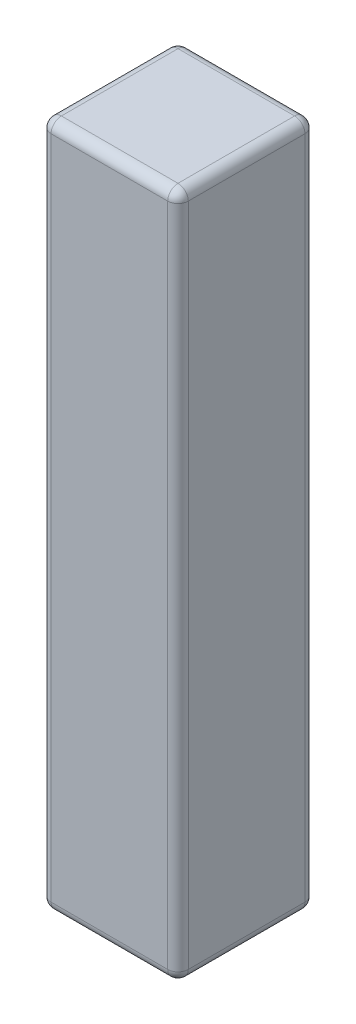
ISO-10303-21;
HEADER;
FILE_DESCRIPTION(('STEP AP214'),'2;1');
FILE_NAME('part.step','',(''),(''),'','','');
FILE_SCHEMA(('AUTOMOTIVE_DESIGN { 1 0 10303 214 1 1 1 1 }'));
ENDSEC;
DATA;
#1=APPLICATION_CONTEXT('core data for automotive mechanical design processes');
#2=APPLICATION_PROTOCOL_DEFINITION('international standard','automotive_design',2000,#1);
#3=PRODUCT_CONTEXT('',#1,'mechanical');
#4=PRODUCT('Part','Part','',(#3));
#5=PRODUCT_RELATED_PRODUCT_CATEGORY('part','',(#4));
#6=PRODUCT_DEFINITION_FORMATION('','',#4);
#7=PRODUCT_DEFINITION_CONTEXT('part definition',#1,'design');
#8=PRODUCT_DEFINITION('design','',#6,#7);
#9=PRODUCT_DEFINITION_SHAPE('','',#8);
#10=(LENGTH_UNIT() NAMED_UNIT(*) SI_UNIT(.MILLI.,.METRE.));
#11=(NAMED_UNIT(*) PLANE_ANGLE_UNIT() SI_UNIT($,.RADIAN.));
#12=(NAMED_UNIT(*) SI_UNIT($,.STERADIAN.) SOLID_ANGLE_UNIT());
#13=UNCERTAINTY_MEASURE_WITH_UNIT(LENGTH_MEASURE(1.E-05),#10,'distance_accuracy_value','');
#14=(GEOMETRIC_REPRESENTATION_CONTEXT(3) GLOBAL_UNCERTAINTY_ASSIGNED_CONTEXT((#13)) GLOBAL_UNIT_ASSIGNED_CONTEXT((#10,
#11,#12)) REPRESENTATION_CONTEXT('',''));
#15=CARTESIAN_POINT('',(0.,0.,0.));
#16=DIRECTION('',(0.,0.,1.));
#17=DIRECTION('',(1.,0.,0.));
#18=AXIS2_PLACEMENT_3D('',#15,#16,#17);
#19=CARTESIAN_POINT('',(-1.00000054,5.,-1.00000054));
#20=DIRECTION('',(1.,0.,0.));
#21=DIRECTION('',(0.,0.,-1.));
#22=AXIS2_PLACEMENT_3D('',#19,#20,#21);
#23=PLANE('',#22);
#24=DIRECTION('',(0.,-1.,0.));
#25=VECTOR('',#24,1.);
#26=CARTESIAN_POINT('',(-1.00000054,5.,0.85000054));
#27=LINE('',#26,#25);
#28=CARTESIAN_POINT('',(-1.00000054,-4.85,0.85000054));
#29=VERTEX_POINT('',#28);
#30=CARTESIAN_POINT('',(-1.00000054,4.85,0.85000054));
#31=VERTEX_POINT('',#30);
#32=EDGE_CURVE('E214',#29,#31,#27,.F.);
#33=ORIENTED_EDGE('',*,*,#32,.T.);
#34=DIRECTION('',(0.,0.,1.));
#35=VECTOR('',#34,1.);
#36=CARTESIAN_POINT('',(-1.00000054,4.85,-1.00000054));
#37=LINE('',#36,#35);
#38=CARTESIAN_POINT('',(-1.00000054,4.85,-0.85000054));
#39=VERTEX_POINT('',#38);
#40=EDGE_CURVE('E217',#31,#39,#37,.F.);
#41=ORIENTED_EDGE('',*,*,#40,.T.);
#42=DIRECTION('',(0.,-1.,0.));
#43=VECTOR('',#42,1.);
#44=CARTESIAN_POINT('',(-1.00000054,5.,-0.85000054));
#45=LINE('',#44,#43);
#46=CARTESIAN_POINT('',(-1.00000054,-4.85,-0.85000054));
#47=VERTEX_POINT('',#46);
#48=EDGE_CURVE('E215',#39,#47,#45,.T.);
#49=ORIENTED_EDGE('',*,*,#48,.T.);
#50=DIRECTION('',(0.,0.,1.));
#51=VECTOR('',#50,1.);
#52=CARTESIAN_POINT('',(-1.00000054,-4.85,-1.00000054));
#53=LINE('',#52,#51);
#54=EDGE_CURVE('E211',#47,#29,#53,.T.);
#55=ORIENTED_EDGE('',*,*,#54,.T.);
#56=EDGE_LOOP('',(#33,#41,#49,#55));
#57=FACE_BOUND('',#56,.T.);
#58=ADVANCED_FACE('F32',(#57),#23,.F.);
#59=CARTESIAN_POINT('',(-1.00000054,5.,1.00000054));
#60=DIRECTION('',(0.,0.,-1.));
#61=DIRECTION('',(-1.,0.,0.));
#62=AXIS2_PLACEMENT_3D('',#59,#60,#61);
#63=PLANE('',#62);
#64=DIRECTION('',(1.,0.,0.));
#65=VECTOR('',#64,1.);
#66=CARTESIAN_POINT('',(-1.00000054,-4.85,1.00000054));
#67=LINE('',#66,#65);
#68=CARTESIAN_POINT('',(-0.85000054,-4.85,1.00000054));
#69=VERTEX_POINT('',#68);
#70=CARTESIAN_POINT('',(0.85000054,-4.85,1.00000054));
#71=VERTEX_POINT('',#70);
#72=EDGE_CURVE('E255',#69,#71,#67,.T.);
#73=ORIENTED_EDGE('',*,*,#72,.T.);
#74=DIRECTION('',(0.,-1.,0.));
#75=VECTOR('',#74,1.);
#76=CARTESIAN_POINT('',(0.85000054,5.,1.00000054));
#77=LINE('',#76,#75);
#78=CARTESIAN_POINT('',(0.85000054,4.85,1.00000054));
#79=VERTEX_POINT('',#78);
#80=EDGE_CURVE('E261',#71,#79,#77,.F.);
#81=ORIENTED_EDGE('',*,*,#80,.T.);
#82=DIRECTION('',(1.,0.,0.));
#83=VECTOR('',#82,1.);
#84=CARTESIAN_POINT('',(-1.00000054,4.85,1.00000054));
#85=LINE('',#84,#83);
#86=CARTESIAN_POINT('',(-0.85000054,4.85,1.00000054));
#87=VERTEX_POINT('',#86);
#88=EDGE_CURVE('E258',#79,#87,#85,.F.);
#89=ORIENTED_EDGE('',*,*,#88,.T.);
#90=DIRECTION('',(0.,-1.,0.));
#91=VECTOR('',#90,1.);
#92=CARTESIAN_POINT('',(-0.85000054,5.,1.00000054));
#93=LINE('',#92,#91);
#94=EDGE_CURVE('E250',#87,#69,#93,.T.);
#95=ORIENTED_EDGE('',*,*,#94,.T.);
#96=EDGE_LOOP('',(#73,#81,#89,#95));
#97=FACE_BOUND('',#96,.T.);
#98=ADVANCED_FACE('F259',(#97),#63,.F.);
#99=CARTESIAN_POINT('',(1.00000054,5.,-1.00000054));
#100=DIRECTION('',(-1.,0.,0.));
#101=DIRECTION('',(0.,0.,1.));
#102=AXIS2_PLACEMENT_3D('',#99,#100,#101);
#103=PLANE('',#102);
#104=DIRECTION('',(0.,0.,-1.));
#105=VECTOR('',#104,1.);
#106=CARTESIAN_POINT('',(1.00000054,4.85,1.00000054));
#107=LINE('',#106,#105);
#108=CARTESIAN_POINT('',(1.00000054,4.85,-0.85000054));
#109=VERTEX_POINT('',#108);
#110=CARTESIAN_POINT('',(1.00000054,4.85,0.85000054));
#111=VERTEX_POINT('',#110);
#112=EDGE_CURVE('E151',#109,#111,#107,.F.);
#113=ORIENTED_EDGE('',*,*,#112,.T.);
#114=DIRECTION('',(0.,-1.,0.));
#115=VECTOR('',#114,1.);
#116=CARTESIAN_POINT('',(1.00000054,5.,0.85000054));
#117=LINE('',#116,#115);
#118=CARTESIAN_POINT('',(1.00000054,-4.85,0.85000054));
#119=VERTEX_POINT('',#118);
#120=EDGE_CURVE('E219',#111,#119,#117,.T.);
#121=ORIENTED_EDGE('',*,*,#120,.T.);
#122=DIRECTION('',(0.,0.,-1.));
#123=VECTOR('',#122,1.);
#124=CARTESIAN_POINT('',(1.00000054,-4.85,-1.00000054));
#125=LINE('',#124,#123);
#126=CARTESIAN_POINT('',(1.00000054,-4.85,-0.85000054));
#127=VERTEX_POINT('',#126);
#128=EDGE_CURVE('E278',#119,#127,#125,.T.);
#129=ORIENTED_EDGE('',*,*,#128,.T.);
#130=DIRECTION('',(0.,-1.,0.));
#131=VECTOR('',#130,1.);
#132=CARTESIAN_POINT('',(1.00000054,5.,-0.85000054));
#133=LINE('',#132,#131);
#134=EDGE_CURVE('E276',#127,#109,#133,.F.);
#135=ORIENTED_EDGE('',*,*,#134,.T.);
#136=EDGE_LOOP('',(#113,#121,#129,#135));
#137=FACE_BOUND('',#136,.T.);
#138=ADVANCED_FACE('F283',(#137),#103,.F.);
#139=CARTESIAN_POINT('',(-1.00000054,5.,-1.00000054));
#140=DIRECTION('',(0.,0.,1.));
#141=DIRECTION('',(1.,0.,0.));
#142=AXIS2_PLACEMENT_3D('',#139,#140,#141);
#143=PLANE('',#142);
#144=DIRECTION('',(-1.,0.,0.));
#145=VECTOR('',#144,1.);
#146=CARTESIAN_POINT('',(1.00000054,4.85,-1.00000054));
#147=LINE('',#146,#145);
#148=CARTESIAN_POINT('',(-0.85000054,4.85,-1.00000054));
#149=VERTEX_POINT('',#148);
#150=CARTESIAN_POINT('',(0.85000054,4.85,-1.00000054));
#151=VERTEX_POINT('',#150);
#152=EDGE_CURVE('E41',#149,#151,#147,.F.);
#153=ORIENTED_EDGE('',*,*,#152,.T.);
#154=DIRECTION('',(0.,-1.,0.));
#155=VECTOR('',#154,1.);
#156=CARTESIAN_POINT('',(0.85000054,5.,-1.00000054));
#157=LINE('',#156,#155);
#158=CARTESIAN_POINT('',(0.85000054,-4.85,-1.00000054));
#159=VERTEX_POINT('',#158);
#160=EDGE_CURVE('E11',#151,#159,#157,.T.);
#161=ORIENTED_EDGE('',*,*,#160,.T.);
#162=DIRECTION('',(-1.,0.,0.));
#163=VECTOR('',#162,1.);
#164=CARTESIAN_POINT('',(-1.00000054,-4.85,-1.00000054));
#165=LINE('',#164,#163);
#166=CARTESIAN_POINT('',(-0.85000054,-4.85,-1.00000054));
#167=VERTEX_POINT('',#166);
#168=EDGE_CURVE('E225',#159,#167,#165,.T.);
#169=ORIENTED_EDGE('',*,*,#168,.T.);
#170=DIRECTION('',(0.,-1.,0.));
#171=VECTOR('',#170,1.);
#172=CARTESIAN_POINT('',(-0.85000054,5.,-1.00000054));
#173=LINE('',#172,#171);
#174=EDGE_CURVE('E52',#167,#149,#173,.F.);
#175=ORIENTED_EDGE('',*,*,#174,.T.);
#176=EDGE_LOOP('',(#153,#161,#169,#175));
#177=FACE_BOUND('',#176,.T.);
#178=ADVANCED_FACE('F354',(#177),#143,.F.);
#179=CARTESIAN_POINT('',(-1.00000054,5.,1.00000054));
#180=DIRECTION('',(0.,1.,0.));
#181=DIRECTION('',(0.,0.,1.));
#182=AXIS2_PLACEMENT_3D('',#179,#180,#181);
#183=PLANE('',#182);
#184=DIRECTION('',(0.,0.,1.));
#185=VECTOR('',#184,1.);
#186=CARTESIAN_POINT('',(-0.85000054,5.,1.00000054));
#187=LINE('',#186,#185);
#188=CARTESIAN_POINT('',(-0.85000054,5.,-0.85000054));
#189=VERTEX_POINT('',#188);
#190=CARTESIAN_POINT('',(-0.85000054,5.,0.85000054));
#191=VERTEX_POINT('',#190);
#192=EDGE_CURVE('E130',#189,#191,#187,.T.);
#193=ORIENTED_EDGE('',*,*,#192,.T.);
#194=DIRECTION('',(1.,0.,0.));
#195=VECTOR('',#194,1.);
#196=CARTESIAN_POINT('',(1.00000054,5.,0.85000054));
#197=LINE('',#196,#195);
#198=CARTESIAN_POINT('',(0.85000054,5.,0.85000054));
#199=VERTEX_POINT('',#198);
#200=EDGE_CURVE('E126',#191,#199,#197,.T.);
#201=ORIENTED_EDGE('',*,*,#200,.T.);
#202=DIRECTION('',(0.,0.,-1.));
#203=VECTOR('',#202,1.);
#204=CARTESIAN_POINT('',(0.85000054,5.,-1.00000054));
#205=LINE('',#204,#203);
#206=CARTESIAN_POINT('',(0.85000054,5.,-0.85000054));
#207=VERTEX_POINT('',#206);
#208=EDGE_CURVE('E120',#199,#207,#205,.T.);
#209=ORIENTED_EDGE('',*,*,#208,.T.);
#210=DIRECTION('',(-1.,0.,0.));
#211=VECTOR('',#210,1.);
#212=CARTESIAN_POINT('',(-1.00000054,5.,-0.85000054));
#213=LINE('',#212,#211);
#214=EDGE_CURVE('E123',#207,#189,#213,.T.);
#215=ORIENTED_EDGE('',*,*,#214,.T.);
#216=EDGE_LOOP('',(#193,#201,#209,#215));
#217=FACE_BOUND('',#216,.T.);
#218=ADVANCED_FACE('F122',(#217),#183,.T.);
#219=CARTESIAN_POINT('',(-1.00000054,-5.,1.00000054));
#220=DIRECTION('',(0.,1.,0.));
#221=DIRECTION('',(0.,0.,1.));
#222=AXIS2_PLACEMENT_3D('',#219,#220,#221);
#223=PLANE('',#222);
#224=DIRECTION('',(0.,0.,-1.));
#225=VECTOR('',#224,1.);
#226=CARTESIAN_POINT('',(0.85000054,-5.,1.00000054));
#227=LINE('',#226,#225);
#228=CARTESIAN_POINT('',(0.85000054,-5.,-0.85000054));
#229=VERTEX_POINT('',#228);
#230=CARTESIAN_POINT('',(0.85000054,-5.,0.85000054));
#231=VERTEX_POINT('',#230);
#232=EDGE_CURVE('E272',#229,#231,#227,.F.);
#233=ORIENTED_EDGE('',*,*,#232,.T.);
#234=DIRECTION('',(1.,0.,0.));
#235=VECTOR('',#234,1.);
#236=CARTESIAN_POINT('',(-1.00000054,-5.,0.85000054));
#237=LINE('',#236,#235);
#238=CARTESIAN_POINT('',(-0.85000054,-5.,0.85000054));
#239=VERTEX_POINT('',#238);
#240=EDGE_CURVE('E274',#231,#239,#237,.F.);
#241=ORIENTED_EDGE('',*,*,#240,.T.);
#242=DIRECTION('',(0.,0.,1.));
#243=VECTOR('',#242,1.);
#244=CARTESIAN_POINT('',(-0.85000054,-5.,1.00000054));
#245=LINE('',#244,#243);
#246=CARTESIAN_POINT('',(-0.85000054,-5.,-0.85000054));
#247=VERTEX_POINT('',#246);
#248=EDGE_CURVE('E209',#239,#247,#245,.F.);
#249=ORIENTED_EDGE('',*,*,#248,.T.);
#250=DIRECTION('',(-1.,0.,0.));
#251=VECTOR('',#250,1.);
#252=CARTESIAN_POINT('',(-1.00000054,-5.,-0.85000054));
#253=LINE('',#252,#251);
#254=EDGE_CURVE('E266',#247,#229,#253,.F.);
#255=ORIENTED_EDGE('',*,*,#254,.T.);
#256=EDGE_LOOP('',(#233,#241,#249,#255));
#257=FACE_BOUND('',#256,.T.);
#258=ADVANCED_FACE('F355',(#257),#223,.F.);
#259=CARTESIAN_POINT('',(-1.00000054,-4.85,-0.85000054));
#260=DIRECTION('',(-1.,0.,0.));
#261=DIRECTION('',(0.,0.,1.));
#262=AXIS2_PLACEMENT_3D('',#259,#260,#261);
#263=CYLINDRICAL_SURFACE('',#262,0.15);
#264=CARTESIAN_POINT('',(-0.85000054,-4.85,-0.85000054));
#265=DIRECTION('',(-1.,0.,0.));
#266=DIRECTION('',(0.,0.,1.));
#267=AXIS2_PLACEMENT_3D('',#264,#265,#266);
#268=CIRCLE('',#267,0.15);
#269=EDGE_CURVE('E36',#167,#247,#268,.T.);
#270=ORIENTED_EDGE('',*,*,#269,.F.);
#271=ORIENTED_EDGE('',*,*,#168,.F.);
#272=CARTESIAN_POINT('',(0.85000054,-4.85,-0.85000054));
#273=DIRECTION('',(1.,0.,0.));
#274=DIRECTION('',(0.,0.,-1.));
#275=AXIS2_PLACEMENT_3D('',#272,#273,#274);
#276=CIRCLE('',#275,0.15);
#277=EDGE_CURVE('E189',#229,#159,#276,.T.);
#278=ORIENTED_EDGE('',*,*,#277,.F.);
#279=ORIENTED_EDGE('',*,*,#254,.F.);
#280=EDGE_LOOP('',(#270,#271,#278,#279));
#281=FACE_BOUND('',#280,.T.);
#282=ADVANCED_FACE('F34',(#281),#263,.T.);
#283=CARTESIAN_POINT('',(-0.85000054,-4.85,-0.85000054));
#284=DIRECTION('',(0.,0.,1.));
#285=DIRECTION('',(1.,0.,0.));
#286=AXIS2_PLACEMENT_3D('',#283,#284,#285);
#287=SPHERICAL_SURFACE('',#286,0.15);
#288=CARTESIAN_POINT('',(-0.85000054,-4.85,-0.85000054));
#289=DIRECTION('',(0.,-1.,0.));
#290=DIRECTION('',(0.,0.,-1.));
#291=AXIS2_PLACEMENT_3D('',#288,#289,#290);
#292=CIRCLE('',#291,0.15);
#293=EDGE_CURVE('E184',#167,#47,#292,.F.);
#294=ORIENTED_EDGE('',*,*,#293,.F.);
#295=ORIENTED_EDGE('',*,*,#269,.T.);
#296=CARTESIAN_POINT('',(-0.85000054,-4.85,-0.85000054));
#297=DIRECTION('',(0.,0.,-1.));
#298=DIRECTION('',(-1.,0.,0.));
#299=AXIS2_PLACEMENT_3D('',#296,#297,#298);
#300=CIRCLE('',#299,0.15);
#301=EDGE_CURVE('E187',#47,#247,#300,.F.);
#302=ORIENTED_EDGE('',*,*,#301,.F.);
#303=EDGE_LOOP('',(#294,#295,#302));
#304=FACE_BOUND('',#303,.T.);
#305=ADVANCED_FACE('F201',(#304),#287,.T.);
#306=CARTESIAN_POINT('',(0.85000054,-4.85,-0.85000054));
#307=DIRECTION('',(0.,0.,1.));
#308=DIRECTION('',(1.,0.,0.));
#309=AXIS2_PLACEMENT_3D('',#306,#307,#308);
#310=SPHERICAL_SURFACE('',#309,0.15);
#311=CARTESIAN_POINT('',(0.85000054,-4.85,-0.85000054));
#312=DIRECTION('',(0.,0.,-1.));
#313=DIRECTION('',(-1.,0.,0.));
#314=AXIS2_PLACEMENT_3D('',#311,#312,#313);
#315=CIRCLE('',#314,0.15);
#316=EDGE_CURVE('E179',#229,#127,#315,.F.);
#317=ORIENTED_EDGE('',*,*,#316,.F.);
#318=ORIENTED_EDGE('',*,*,#277,.T.);
#319=CARTESIAN_POINT('',(0.85000054,-4.85,-0.85000054));
#320=DIRECTION('',(0.,-1.,0.));
#321=DIRECTION('',(0.,0.,-1.));
#322=AXIS2_PLACEMENT_3D('',#319,#320,#321);
#323=CIRCLE('',#322,0.15);
#324=EDGE_CURVE('E182',#127,#159,#323,.F.);
#325=ORIENTED_EDGE('',*,*,#324,.F.);
#326=EDGE_LOOP('',(#317,#318,#325));
#327=FACE_BOUND('',#326,.T.);
#328=ADVANCED_FACE('F351',(#327),#310,.T.);
#329=CARTESIAN_POINT('',(-0.85000054,-4.85,-1.00000054));
#330=DIRECTION('',(0.,0.,1.));
#331=DIRECTION('',(1.,0.,0.));
#332=AXIS2_PLACEMENT_3D('',#329,#330,#331);
#333=CYLINDRICAL_SURFACE('',#332,0.15);
#334=ORIENTED_EDGE('',*,*,#301,.T.);
#335=ORIENTED_EDGE('',*,*,#248,.F.);
#336=CARTESIAN_POINT('',(-0.85000054,-4.85,0.85000054));
#337=DIRECTION('',(0.,0.,1.));
#338=DIRECTION('',(1.,0.,0.));
#339=AXIS2_PLACEMENT_3D('',#336,#337,#338);
#340=CIRCLE('',#339,0.15);
#341=EDGE_CURVE('E174',#29,#239,#340,.T.);
#342=ORIENTED_EDGE('',*,*,#341,.F.);
#343=ORIENTED_EDGE('',*,*,#54,.F.);
#344=EDGE_LOOP('',(#334,#335,#342,#343));
#345=FACE_BOUND('',#344,.T.);
#346=ADVANCED_FACE('F207',(#345),#333,.T.);
#347=CARTESIAN_POINT('',(-0.85000054,5.,-0.85000054));
#348=DIRECTION('',(0.,-1.,0.));
#349=DIRECTION('',(0.,0.,-1.));
#350=AXIS2_PLACEMENT_3D('',#347,#348,#349);
#351=CYLINDRICAL_SURFACE('',#350,0.15);
#352=ORIENTED_EDGE('',*,*,#293,.T.);
#353=ORIENTED_EDGE('',*,*,#48,.F.);
#354=CARTESIAN_POINT('',(-0.85000054,4.85,-0.85000054));
#355=DIRECTION('',(0.,1.,0.));
#356=DIRECTION('',(0.,0.,1.));
#357=AXIS2_PLACEMENT_3D('',#354,#355,#356);
#358=CIRCLE('',#357,0.15);
#359=EDGE_CURVE('E171',#149,#39,#358,.T.);
#360=ORIENTED_EDGE('',*,*,#359,.F.);
#361=ORIENTED_EDGE('',*,*,#174,.F.);
#362=EDGE_LOOP('',(#352,#353,#360,#361));
#363=FACE_BOUND('',#362,.T.);
#364=ADVANCED_FACE('F300',(#363),#351,.T.);
#365=CARTESIAN_POINT('',(-1.00000054,4.85,-0.85000054));
#366=DIRECTION('',(1.,0.,0.));
#367=DIRECTION('',(0.,0.,-1.));
#368=AXIS2_PLACEMENT_3D('',#365,#366,#367);
#369=CYLINDRICAL_SURFACE('',#368,0.15);
#370=CARTESIAN_POINT('',(0.85000054,4.85,-0.85000054));
#371=DIRECTION('',(1.,0.,0.));
#372=DIRECTION('',(0.,0.,-1.));
#373=AXIS2_PLACEMENT_3D('',#370,#371,#372);
#374=CIRCLE('',#373,0.15);
#375=EDGE_CURVE('E136',#151,#207,#374,.T.);
#376=ORIENTED_EDGE('',*,*,#375,.F.);
#377=ORIENTED_EDGE('',*,*,#152,.F.);
#378=CARTESIAN_POINT('',(-0.85000054,4.85,-0.85000054));
#379=DIRECTION('',(-1.,0.,0.));
#380=DIRECTION('',(0.,0.,1.));
#381=AXIS2_PLACEMENT_3D('',#378,#379,#380);
#382=CIRCLE('',#381,0.15);
#383=EDGE_CURVE('E139',#189,#149,#382,.T.);
#384=ORIENTED_EDGE('',*,*,#383,.F.);
#385=ORIENTED_EDGE('',*,*,#214,.F.);
#386=EDGE_LOOP('',(#376,#377,#384,#385));
#387=FACE_BOUND('',#386,.T.);
#388=ADVANCED_FACE('F135',(#387),#369,.T.);
#389=CARTESIAN_POINT('',(0.85000054,5.,-0.85000054));
#390=DIRECTION('',(0.,-1.,0.));
#391=DIRECTION('',(0.,0.,-1.));
#392=AXIS2_PLACEMENT_3D('',#389,#390,#391);
#393=CYLINDRICAL_SURFACE('',#392,0.15);
#394=ORIENTED_EDGE('',*,*,#324,.T.);
#395=ORIENTED_EDGE('',*,*,#160,.F.);
#396=CARTESIAN_POINT('',(0.85000054,4.85,-0.85000054));
#397=DIRECTION('',(0.,1.,0.));
#398=DIRECTION('',(0.,0.,1.));
#399=AXIS2_PLACEMENT_3D('',#396,#397,#398);
#400=CIRCLE('',#399,0.15);
#401=EDGE_CURVE('E148',#109,#151,#400,.T.);
#402=ORIENTED_EDGE('',*,*,#401,.F.);
#403=ORIENTED_EDGE('',*,*,#134,.F.);
#404=EDGE_LOOP('',(#394,#395,#402,#403));
#405=FACE_BOUND('',#404,.T.);
#406=ADVANCED_FACE('F353',(#405),#393,.T.);
#407=CARTESIAN_POINT('',(0.85000054,-4.85,-1.00000054));
#408=DIRECTION('',(0.,0.,-1.));
#409=DIRECTION('',(-1.,0.,0.));
#410=AXIS2_PLACEMENT_3D('',#407,#408,#409);
#411=CYLINDRICAL_SURFACE('',#410,0.15);
#412=ORIENTED_EDGE('',*,*,#316,.T.);
#413=ORIENTED_EDGE('',*,*,#128,.F.);
#414=CARTESIAN_POINT('',(0.85000054,-4.85,0.85000054));
#415=DIRECTION('',(0.,0.,1.));
#416=DIRECTION('',(1.,0.,0.));
#417=AXIS2_PLACEMENT_3D('',#414,#415,#416);
#418=CIRCLE('',#417,0.15);
#419=EDGE_CURVE('E166',#231,#119,#418,.T.);
#420=ORIENTED_EDGE('',*,*,#419,.F.);
#421=ORIENTED_EDGE('',*,*,#232,.F.);
#422=EDGE_LOOP('',(#412,#413,#420,#421));
#423=FACE_BOUND('',#422,.T.);
#424=ADVANCED_FACE('F349',(#423),#411,.T.);
#425=CARTESIAN_POINT('',(-1.00000054,-4.85,0.85000054));
#426=DIRECTION('',(1.,0.,0.));
#427=DIRECTION('',(0.,0.,-1.));
#428=AXIS2_PLACEMENT_3D('',#425,#426,#427);
#429=CYLINDRICAL_SURFACE('',#428,0.15);
#430=CARTESIAN_POINT('',(-0.85000054,-4.85,0.85000054));
#431=DIRECTION('',(-1.,0.,0.));
#432=DIRECTION('',(0.,0.,1.));
#433=AXIS2_PLACEMENT_3D('',#430,#431,#432);
#434=CIRCLE('',#433,0.15);
#435=EDGE_CURVE('E176',#239,#69,#434,.T.);
#436=ORIENTED_EDGE('',*,*,#435,.F.);
#437=ORIENTED_EDGE('',*,*,#240,.F.);
#438=CARTESIAN_POINT('',(0.85000054,-4.85,0.85000054));
#439=DIRECTION('',(1.,0.,0.));
#440=DIRECTION('',(0.,0.,-1.));
#441=AXIS2_PLACEMENT_3D('',#438,#439,#440);
#442=CIRCLE('',#441,0.15);
#443=EDGE_CURVE('E163',#71,#231,#442,.T.);
#444=ORIENTED_EDGE('',*,*,#443,.F.);
#445=ORIENTED_EDGE('',*,*,#72,.F.);
#446=EDGE_LOOP('',(#436,#437,#444,#445));
#447=FACE_BOUND('',#446,.T.);
#448=ADVANCED_FACE('F312',(#447),#429,.T.);
#449=CARTESIAN_POINT('',(-0.85000054,-4.85,0.85000054));
#450=DIRECTION('',(0.,0.,1.));
#451=DIRECTION('',(1.,0.,0.));
#452=AXIS2_PLACEMENT_3D('',#449,#450,#451);
#453=SPHERICAL_SURFACE('',#452,0.15);
#454=ORIENTED_EDGE('',*,*,#341,.T.);
#455=ORIENTED_EDGE('',*,*,#435,.T.);
#456=CARTESIAN_POINT('',(-0.85000054,-4.85,0.85000054));
#457=DIRECTION('',(0.,-1.,0.));
#458=DIRECTION('',(0.,0.,-1.));
#459=AXIS2_PLACEMENT_3D('',#456,#457,#458);
#460=CIRCLE('',#459,0.15);
#461=EDGE_CURVE('E155',#29,#69,#460,.F.);
#462=ORIENTED_EDGE('',*,*,#461,.F.);
#463=EDGE_LOOP('',(#454,#455,#462));
#464=FACE_BOUND('',#463,.T.);
#465=ADVANCED_FACE('F304',(#464),#453,.T.);
#466=CARTESIAN_POINT('',(-0.85000054,4.85,-0.85000054));
#467=DIRECTION('',(0.,0.,1.));
#468=DIRECTION('',(1.,0.,0.));
#469=AXIS2_PLACEMENT_3D('',#466,#467,#468);
#470=SPHERICAL_SURFACE('',#469,0.15);
#471=ORIENTED_EDGE('',*,*,#383,.T.);
#472=ORIENTED_EDGE('',*,*,#359,.T.);
#473=CARTESIAN_POINT('',(-0.85000054,4.85,-0.85000054));
#474=DIRECTION('',(0.,0.,-1.));
#475=DIRECTION('',(-1.,0.,0.));
#476=AXIS2_PLACEMENT_3D('',#473,#474,#475);
#477=CIRCLE('',#476,0.15);
#478=EDGE_CURVE('E152',#189,#39,#477,.F.);
#479=ORIENTED_EDGE('',*,*,#478,.F.);
#480=EDGE_LOOP('',(#471,#472,#479));
#481=FACE_BOUND('',#480,.T.);
#482=ADVANCED_FACE('F302',(#481),#470,.T.);
#483=CARTESIAN_POINT('',(0.85000054,4.85,-0.85000054));
#484=DIRECTION('',(0.,0.,1.));
#485=DIRECTION('',(1.,0.,0.));
#486=AXIS2_PLACEMENT_3D('',#483,#484,#485);
#487=SPHERICAL_SURFACE('',#486,0.15);
#488=ORIENTED_EDGE('',*,*,#401,.T.);
#489=ORIENTED_EDGE('',*,*,#375,.T.);
#490=CARTESIAN_POINT('',(0.85000054,4.85,-0.85000054));
#491=DIRECTION('',(0.,0.,-1.));
#492=DIRECTION('',(-1.,0.,0.));
#493=AXIS2_PLACEMENT_3D('',#490,#491,#492);
#494=CIRCLE('',#493,0.15);
#495=EDGE_CURVE('E145',#109,#207,#494,.F.);
#496=ORIENTED_EDGE('',*,*,#495,.F.);
#497=EDGE_LOOP('',(#488,#489,#496));
#498=FACE_BOUND('',#497,.T.);
#499=ADVANCED_FACE('F144',(#498),#487,.T.);
#500=CARTESIAN_POINT('',(0.85000054,-4.85,0.85000054));
#501=DIRECTION('',(0.,0.,1.));
#502=DIRECTION('',(1.,0.,0.));
#503=AXIS2_PLACEMENT_3D('',#500,#501,#502);
#504=SPHERICAL_SURFACE('',#503,0.15);
#505=ORIENTED_EDGE('',*,*,#443,.T.);
#506=ORIENTED_EDGE('',*,*,#419,.T.);
#507=CARTESIAN_POINT('',(0.85000054,-4.85,0.85000054));
#508=DIRECTION('',(0.,-1.,0.));
#509=DIRECTION('',(0.,0.,-1.));
#510=AXIS2_PLACEMENT_3D('',#507,#508,#509);
#511=CIRCLE('',#510,0.15);
#512=EDGE_CURVE('E153',#71,#119,#511,.F.);
#513=ORIENTED_EDGE('',*,*,#512,.F.);
#514=EDGE_LOOP('',(#505,#506,#513));
#515=FACE_BOUND('',#514,.T.);
#516=ADVANCED_FACE('F310',(#515),#504,.T.);
#517=CARTESIAN_POINT('',(-0.85000054,5.,0.85000054));
#518=DIRECTION('',(0.,-1.,0.));
#519=DIRECTION('',(0.,0.,-1.));
#520=AXIS2_PLACEMENT_3D('',#517,#518,#519);
#521=CYLINDRICAL_SURFACE('',#520,0.15);
#522=ORIENTED_EDGE('',*,*,#461,.T.);
#523=ORIENTED_EDGE('',*,*,#94,.F.);
#524=CARTESIAN_POINT('',(-0.85000054,4.85,0.85000054));
#525=DIRECTION('',(0.,1.,0.));
#526=DIRECTION('',(0.,0.,1.));
#527=AXIS2_PLACEMENT_3D('',#524,#525,#526);
#528=CIRCLE('',#527,0.15);
#529=EDGE_CURVE('E157',#31,#87,#528,.T.);
#530=ORIENTED_EDGE('',*,*,#529,.F.);
#531=ORIENTED_EDGE('',*,*,#32,.F.);
#532=EDGE_LOOP('',(#522,#523,#530,#531));
#533=FACE_BOUND('',#532,.T.);
#534=ADVANCED_FACE('F252',(#533),#521,.T.);
#535=CARTESIAN_POINT('',(-0.85000054,4.85,1.00000054));
#536=DIRECTION('',(0.,0.,-1.));
#537=DIRECTION('',(-1.,0.,0.));
#538=AXIS2_PLACEMENT_3D('',#535,#536,#537);
#539=CYLINDRICAL_SURFACE('',#538,0.15);
#540=ORIENTED_EDGE('',*,*,#478,.T.);
#541=ORIENTED_EDGE('',*,*,#40,.F.);
#542=CARTESIAN_POINT('',(-0.85000054,4.85,0.85000054));
#543=DIRECTION('',(0.,0.,1.));
#544=DIRECTION('',(1.,0.,0.));
#545=AXIS2_PLACEMENT_3D('',#542,#543,#544);
#546=CIRCLE('',#545,0.15);
#547=EDGE_CURVE('E239',#191,#31,#546,.T.);
#548=ORIENTED_EDGE('',*,*,#547,.F.);
#549=ORIENTED_EDGE('',*,*,#192,.F.);
#550=EDGE_LOOP('',(#540,#541,#548,#549));
#551=FACE_BOUND('',#550,.T.);
#552=ADVANCED_FACE('F296',(#551),#539,.T.);
#553=CARTESIAN_POINT('',(0.85000054,4.85,1.00000054));
#554=DIRECTION('',(0.,0.,1.));
#555=DIRECTION('',(1.,0.,0.));
#556=AXIS2_PLACEMENT_3D('',#553,#554,#555);
#557=CYLINDRICAL_SURFACE('',#556,0.15);
#558=ORIENTED_EDGE('',*,*,#495,.T.);
#559=ORIENTED_EDGE('',*,*,#208,.F.);
#560=CARTESIAN_POINT('',(0.85000054,4.85,0.85000054));
#561=DIRECTION('',(0.,0.,1.));
#562=DIRECTION('',(1.,0.,0.));
#563=AXIS2_PLACEMENT_3D('',#560,#561,#562);
#564=CIRCLE('',#563,0.15);
#565=EDGE_CURVE('E236',#111,#199,#564,.T.);
#566=ORIENTED_EDGE('',*,*,#565,.F.);
#567=ORIENTED_EDGE('',*,*,#112,.F.);
#568=EDGE_LOOP('',(#558,#559,#566,#567));
#569=FACE_BOUND('',#568,.T.);
#570=ADVANCED_FACE('F150',(#569),#557,.T.);
#571=CARTESIAN_POINT('',(0.85000054,5.,0.85000054));
#572=DIRECTION('',(0.,-1.,0.));
#573=DIRECTION('',(0.,0.,-1.));
#574=AXIS2_PLACEMENT_3D('',#571,#572,#573);
#575=CYLINDRICAL_SURFACE('',#574,0.15);
#576=ORIENTED_EDGE('',*,*,#512,.T.);
#577=ORIENTED_EDGE('',*,*,#120,.F.);
#578=CARTESIAN_POINT('',(0.85000054,4.85,0.85000054));
#579=DIRECTION('',(0.,1.,0.));
#580=DIRECTION('',(0.,0.,1.));
#581=AXIS2_PLACEMENT_3D('',#578,#579,#580);
#582=CIRCLE('',#581,0.15);
#583=EDGE_CURVE('E233',#79,#111,#582,.T.);
#584=ORIENTED_EDGE('',*,*,#583,.F.);
#585=ORIENTED_EDGE('',*,*,#80,.F.);
#586=EDGE_LOOP('',(#576,#577,#584,#585));
#587=FACE_BOUND('',#586,.T.);
#588=ADVANCED_FACE('F286',(#587),#575,.T.);
#589=CARTESIAN_POINT('',(-0.85000054,4.85,0.85000054));
#590=DIRECTION('',(0.,0.,1.));
#591=DIRECTION('',(1.,0.,0.));
#592=AXIS2_PLACEMENT_3D('',#589,#590,#591);
#593=SPHERICAL_SURFACE('',#592,0.15);
#594=ORIENTED_EDGE('',*,*,#547,.T.);
#595=ORIENTED_EDGE('',*,*,#529,.T.);
#596=CARTESIAN_POINT('',(-0.85000054,4.85,0.85000054));
#597=DIRECTION('',(-1.,0.,0.));
#598=DIRECTION('',(0.,0.,1.));
#599=AXIS2_PLACEMENT_3D('',#596,#597,#598);
#600=CIRCLE('',#599,0.15);
#601=EDGE_CURVE('E231',#191,#87,#600,.F.);
#602=ORIENTED_EDGE('',*,*,#601,.F.);
#603=EDGE_LOOP('',(#594,#595,#602));
#604=FACE_BOUND('',#603,.T.);
#605=ADVANCED_FACE('F246',(#604),#593,.T.);
#606=CARTESIAN_POINT('',(0.85000054,4.85,0.85000054));
#607=DIRECTION('',(0.,0.,1.));
#608=DIRECTION('',(1.,0.,0.));
#609=AXIS2_PLACEMENT_3D('',#606,#607,#608);
#610=SPHERICAL_SURFACE('',#609,0.15);
#611=ORIENTED_EDGE('',*,*,#583,.T.);
#612=ORIENTED_EDGE('',*,*,#565,.T.);
#613=CARTESIAN_POINT('',(0.85000054,4.85,0.85000054));
#614=DIRECTION('',(1.,0.,0.));
#615=DIRECTION('',(0.,0.,-1.));
#616=AXIS2_PLACEMENT_3D('',#613,#614,#615);
#617=CIRCLE('',#616,0.15);
#618=EDGE_CURVE('E229',#79,#199,#617,.F.);
#619=ORIENTED_EDGE('',*,*,#618,.F.);
#620=EDGE_LOOP('',(#611,#612,#619));
#621=FACE_BOUND('',#620,.T.);
#622=ADVANCED_FACE('F289',(#621),#610,.T.);
#623=CARTESIAN_POINT('',(-1.00000054,4.85,0.85000054));
#624=DIRECTION('',(-1.,0.,0.));
#625=DIRECTION('',(0.,0.,1.));
#626=AXIS2_PLACEMENT_3D('',#623,#624,#625);
#627=CYLINDRICAL_SURFACE('',#626,0.15);
#628=ORIENTED_EDGE('',*,*,#601,.T.);
#629=ORIENTED_EDGE('',*,*,#88,.F.);
#630=ORIENTED_EDGE('',*,*,#618,.T.);
#631=ORIENTED_EDGE('',*,*,#200,.F.);
#632=EDGE_LOOP('',(#628,#629,#630,#631));
#633=FACE_BOUND('',#632,.T.);
#634=ADVANCED_FACE('F290',(#633),#627,.T.);
#635=CLOSED_SHELL('',(#58,#98,#138,#178,#218,#258,#282,#305,#328,#346,#364,#388,#406,#424,#448,
#465,#482,#499,#516,#534,#552,#570,#588,#605,#622,#634));
#636=MANIFOLD_SOLID_BREP('B2',#635);
#637=ADVANCED_BREP_SHAPE_REPRESENTATION('',(#18,#636),#14);
#638=SHAPE_DEFINITION_REPRESENTATION(#9,#637);
ENDSEC;
END-ISO-10303-21;
